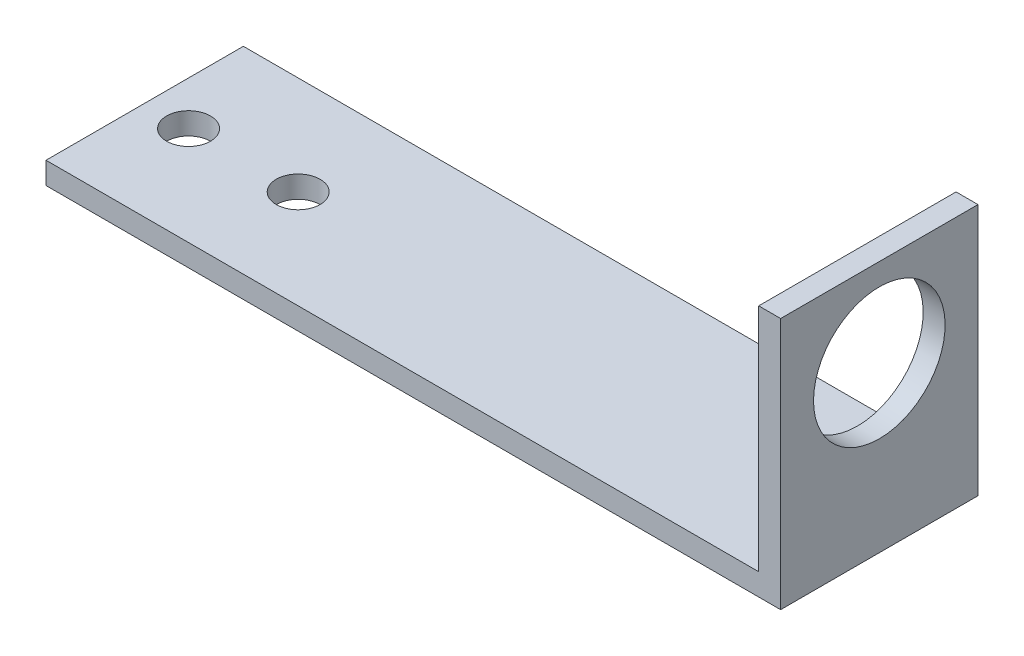
ISO-10303-21;
HEADER;
FILE_DESCRIPTION(('STEP AP214'),'2;1');
FILE_NAME('part.step','',(''),(''),'','','');
FILE_SCHEMA(('AUTOMOTIVE_DESIGN { 1 0 10303 214 1 1 1 1 }'));
ENDSEC;
DATA;
#1=APPLICATION_CONTEXT('core data for automotive mechanical design processes');
#2=APPLICATION_PROTOCOL_DEFINITION('international standard','automotive_design',2000,#1);
#3=PRODUCT_CONTEXT('',#1,'mechanical');
#4=PRODUCT('Part','Part','',(#3));
#5=PRODUCT_RELATED_PRODUCT_CATEGORY('part','',(#4));
#6=PRODUCT_DEFINITION_FORMATION('','',#4);
#7=PRODUCT_DEFINITION_CONTEXT('part definition',#1,'design');
#8=PRODUCT_DEFINITION('design','',#6,#7);
#9=PRODUCT_DEFINITION_SHAPE('','',#8);
#10=(LENGTH_UNIT() NAMED_UNIT(*) SI_UNIT(.MILLI.,.METRE.));
#11=(NAMED_UNIT(*) PLANE_ANGLE_UNIT() SI_UNIT($,.RADIAN.));
#12=(NAMED_UNIT(*) SI_UNIT($,.STERADIAN.) SOLID_ANGLE_UNIT());
#13=UNCERTAINTY_MEASURE_WITH_UNIT(LENGTH_MEASURE(1.E-05),#10,'distance_accuracy_value','');
#14=(GEOMETRIC_REPRESENTATION_CONTEXT(3) GLOBAL_UNCERTAINTY_ASSIGNED_CONTEXT((#13)) GLOBAL_UNIT_ASSIGNED_CONTEXT((#10,
#11,#12)) REPRESENTATION_CONTEXT('',''));
#15=CARTESIAN_POINT('',(0.,0.,0.));
#16=DIRECTION('',(0.,0.,1.));
#17=DIRECTION('',(1.,0.,0.));
#18=AXIS2_PLACEMENT_3D('',#15,#16,#17);
#19=CARTESIAN_POINT('',(-67.,0.,18.));
#20=DIRECTION('',(0.,1.,0.));
#21=DIRECTION('',(0.,0.,1.));
#22=AXIS2_PLACEMENT_3D('',#19,#20,#21);
#23=PLANE('',#22);
#24=CARTESIAN_POINT('',(-63.,0.,9.));
#25=DIRECTION('',(0.,1.,0.));
#26=DIRECTION('',(0.,0.,1.));
#27=AXIS2_PLACEMENT_3D('',#24,#25,#26);
#28=CIRCLE('',#27,2.);
#29=CARTESIAN_POINT('',(-63.,0.,11.));
#30=VERTEX_POINT('',#29);
#31=EDGE_CURVE('E162',#30,#30,#28,.F.);
#32=ORIENTED_EDGE('',*,*,#31,.F.);
#33=EDGE_LOOP('',(#32));
#34=FACE_BOUND('',#33,.T.);
#35=CARTESIAN_POINT('',(-53.,0.,9.));
#36=DIRECTION('',(0.,1.,0.));
#37=DIRECTION('',(0.,0.,1.));
#38=AXIS2_PLACEMENT_3D('',#35,#36,#37);
#39=CIRCLE('',#38,2.);
#40=CARTESIAN_POINT('',(-53.,0.,11.));
#41=VERTEX_POINT('',#40);
#42=EDGE_CURVE('E165',#41,#41,#39,.F.);
#43=ORIENTED_EDGE('',*,*,#42,.F.);
#44=EDGE_LOOP('',(#43));
#45=FACE_BOUND('',#44,.T.);
#46=DIRECTION('',(1.,0.,0.));
#47=VECTOR('',#46,1.);
#48=CARTESIAN_POINT('',(-67.,0.,0.));
#49=LINE('',#48,#47);
#50=CARTESIAN_POINT('',(-67.,0.,0.));
#51=VERTEX_POINT('',#50);
#52=CARTESIAN_POINT('',(0.,0.,0.));
#53=VERTEX_POINT('',#52);
#54=EDGE_CURVE('E117',#51,#53,#49,.T.);
#55=ORIENTED_EDGE('',*,*,#54,.T.);
#56=DIRECTION('',(0.,0.,-1.));
#57=VECTOR('',#56,1.);
#58=CARTESIAN_POINT('',(0.,0.,18.));
#59=LINE('',#58,#57);
#60=CARTESIAN_POINT('',(0.,0.,18.));
#61=VERTEX_POINT('',#60);
#62=EDGE_CURVE('E11',#61,#53,#59,.T.);
#63=ORIENTED_EDGE('',*,*,#62,.F.);
#64=DIRECTION('',(1.,0.,0.));
#65=VECTOR('',#64,1.);
#66=CARTESIAN_POINT('',(-67.,0.,18.));
#67=LINE('',#66,#65);
#68=CARTESIAN_POINT('',(-67.,0.,18.));
#69=VERTEX_POINT('',#68);
#70=EDGE_CURVE('E128',#69,#61,#67,.T.);
#71=ORIENTED_EDGE('',*,*,#70,.F.);
#72=DIRECTION('',(0.,0.,-1.));
#73=VECTOR('',#72,1.);
#74=CARTESIAN_POINT('',(-67.,0.,18.));
#75=LINE('',#74,#73);
#76=EDGE_CURVE('E113',#69,#51,#75,.T.);
#77=ORIENTED_EDGE('',*,*,#76,.T.);
#78=EDGE_LOOP('',(#55,#63,#71,#77));
#79=FACE_BOUND('',#78,.T.);
#80=ADVANCED_FACE('F33',(#34,#45,#79),#23,.F.);
#81=CARTESIAN_POINT('',(0.,0.,18.));
#82=DIRECTION('',(-1.,0.,0.));
#83=DIRECTION('',(0.,0.,1.));
#84=AXIS2_PLACEMENT_3D('',#81,#82,#83);
#85=PLANE('',#84);
#86=CARTESIAN_POINT('',(0.,15.,9.));
#87=DIRECTION('',(-1.,0.,0.));
#88=DIRECTION('',(0.,0.,1.));
#89=AXIS2_PLACEMENT_3D('',#86,#87,#88);
#90=CIRCLE('',#89,6.);
#91=CARTESIAN_POINT('',(0.,15.,15.));
#92=VERTEX_POINT('',#91);
#93=EDGE_CURVE('E121',#92,#92,#90,.F.);
#94=ORIENTED_EDGE('',*,*,#93,.F.);
#95=EDGE_LOOP('',(#94));
#96=FACE_BOUND('',#95,.T.);
#97=DIRECTION('',(0.,1.,0.));
#98=VECTOR('',#97,1.);
#99=CARTESIAN_POINT('',(0.,0.,0.));
#100=LINE('',#99,#98);
#101=CARTESIAN_POINT('',(0.,23.,0.));
#102=VERTEX_POINT('',#101);
#103=EDGE_CURVE('E120',#53,#102,#100,.T.);
#104=ORIENTED_EDGE('',*,*,#103,.T.);
#105=DIRECTION('',(0.,0.,-1.));
#106=VECTOR('',#105,1.);
#107=CARTESIAN_POINT('',(0.,23.,18.));
#108=LINE('',#107,#106);
#109=CARTESIAN_POINT('',(0.,23.,18.));
#110=VERTEX_POINT('',#109);
#111=EDGE_CURVE('E41',#110,#102,#108,.T.);
#112=ORIENTED_EDGE('',*,*,#111,.F.);
#113=DIRECTION('',(0.,1.,0.));
#114=VECTOR('',#113,1.);
#115=CARTESIAN_POINT('',(0.,0.,18.));
#116=LINE('',#115,#114);
#117=EDGE_CURVE('E86',#61,#110,#116,.T.);
#118=ORIENTED_EDGE('',*,*,#117,.F.);
#119=ORIENTED_EDGE('',*,*,#62,.T.);
#120=EDGE_LOOP('',(#104,#112,#118,#119));
#121=FACE_BOUND('',#120,.T.);
#122=ADVANCED_FACE('F153',(#96,#121),#85,.F.);
#123=CARTESIAN_POINT('',(0.,23.,18.));
#124=DIRECTION('',(0.,-1.,0.));
#125=DIRECTION('',(0.,0.,-1.));
#126=AXIS2_PLACEMENT_3D('',#123,#124,#125);
#127=PLANE('',#126);
#128=DIRECTION('',(-1.,0.,0.));
#129=VECTOR('',#128,1.);
#130=CARTESIAN_POINT('',(0.,23.,0.));
#131=LINE('',#130,#129);
#132=CARTESIAN_POINT('',(-2.,23.,0.));
#133=VERTEX_POINT('',#132);
#134=EDGE_CURVE('E123',#102,#133,#131,.T.);
#135=ORIENTED_EDGE('',*,*,#134,.T.);
#136=DIRECTION('',(0.,0.,-1.));
#137=VECTOR('',#136,1.);
#138=CARTESIAN_POINT('',(-2.,23.,18.));
#139=LINE('',#138,#137);
#140=CARTESIAN_POINT('',(-2.,23.,18.));
#141=VERTEX_POINT('',#140);
#142=EDGE_CURVE('E108',#141,#133,#139,.T.);
#143=ORIENTED_EDGE('',*,*,#142,.F.);
#144=DIRECTION('',(-1.,0.,0.));
#145=VECTOR('',#144,1.);
#146=CARTESIAN_POINT('',(0.,23.,18.));
#147=LINE('',#146,#145);
#148=EDGE_CURVE('E99',#110,#141,#147,.T.);
#149=ORIENTED_EDGE('',*,*,#148,.F.);
#150=ORIENTED_EDGE('',*,*,#111,.T.);
#151=EDGE_LOOP('',(#135,#143,#149,#150));
#152=FACE_BOUND('',#151,.T.);
#153=ADVANCED_FACE('F134',(#152),#127,.F.);
#154=CARTESIAN_POINT('',(-2.,23.,18.));
#155=DIRECTION('',(1.,0.,0.));
#156=DIRECTION('',(0.,1.,0.));
#157=AXIS2_PLACEMENT_3D('',#154,#155,#156);
#158=PLANE('',#157);
#159=CARTESIAN_POINT('',(-2.,15.,9.));
#160=DIRECTION('',(-1.,0.,0.));
#161=DIRECTION('',(0.,-1.,0.));
#162=AXIS2_PLACEMENT_3D('',#159,#160,#161);
#163=CIRCLE('',#162,6.);
#164=CARTESIAN_POINT('',(-2.,9.,9.));
#165=VERTEX_POINT('',#164);
#166=EDGE_CURVE('E176',#165,#165,#163,.T.);
#167=ORIENTED_EDGE('',*,*,#166,.F.);
#168=EDGE_LOOP('',(#167));
#169=FACE_BOUND('',#168,.T.);
#170=DIRECTION('',(0.,-1.,0.));
#171=VECTOR('',#170,1.);
#172=CARTESIAN_POINT('',(-2.,23.,0.));
#173=LINE('',#172,#171);
#174=CARTESIAN_POINT('',(-2.,2.00000000000001,0.));
#175=VERTEX_POINT('',#174);
#176=EDGE_CURVE('E107',#133,#175,#173,.T.);
#177=ORIENTED_EDGE('',*,*,#176,.T.);
#178=DIRECTION('',(0.,0.,-1.));
#179=VECTOR('',#178,1.);
#180=CARTESIAN_POINT('',(-2.,2.00000000000001,18.));
#181=LINE('',#180,#179);
#182=CARTESIAN_POINT('',(-2.,2.00000000000001,18.));
#183=VERTEX_POINT('',#182);
#184=EDGE_CURVE('E104',#183,#175,#181,.T.);
#185=ORIENTED_EDGE('',*,*,#184,.F.);
#186=DIRECTION('',(0.,-1.,0.));
#187=VECTOR('',#186,1.);
#188=CARTESIAN_POINT('',(-2.,23.,18.));
#189=LINE('',#188,#187);
#190=EDGE_CURVE('E93',#141,#183,#189,.T.);
#191=ORIENTED_EDGE('',*,*,#190,.F.);
#192=ORIENTED_EDGE('',*,*,#142,.T.);
#193=EDGE_LOOP('',(#177,#185,#191,#192));
#194=FACE_BOUND('',#193,.T.);
#195=ADVANCED_FACE('F105',(#169,#194),#158,.F.);
#196=CARTESIAN_POINT('',(-2.,2.00000000000001,18.));
#197=DIRECTION('',(0.,-1.,0.));
#198=DIRECTION('',(1.,0.,0.));
#199=AXIS2_PLACEMENT_3D('',#196,#197,#198);
#200=PLANE('',#199);
#201=CARTESIAN_POINT('',(-63.,2.,9.));
#202=DIRECTION('',(0.,1.,0.));
#203=DIRECTION('',(-1.,0.,0.));
#204=AXIS2_PLACEMENT_3D('',#201,#202,#203);
#205=CIRCLE('',#204,2.);
#206=CARTESIAN_POINT('',(-65.,2.,9.));
#207=VERTEX_POINT('',#206);
#208=EDGE_CURVE('E167',#207,#207,#205,.T.);
#209=ORIENTED_EDGE('',*,*,#208,.F.);
#210=EDGE_LOOP('',(#209));
#211=FACE_BOUND('',#210,.T.);
#212=CARTESIAN_POINT('',(-53.,2.,9.));
#213=DIRECTION('',(0.,1.,0.));
#214=DIRECTION('',(-1.,0.,0.));
#215=AXIS2_PLACEMENT_3D('',#212,#213,#214);
#216=CIRCLE('',#215,2.);
#217=CARTESIAN_POINT('',(-55.,2.,9.));
#218=VERTEX_POINT('',#217);
#219=EDGE_CURVE('E168',#218,#218,#216,.T.);
#220=ORIENTED_EDGE('',*,*,#219,.F.);
#221=EDGE_LOOP('',(#220));
#222=FACE_BOUND('',#221,.T.);
#223=DIRECTION('',(-1.,0.,0.));
#224=VECTOR('',#223,1.);
#225=CARTESIAN_POINT('',(-2.,2.00000000000001,0.));
#226=LINE('',#225,#224);
#227=CARTESIAN_POINT('',(-67.,2.,0.));
#228=VERTEX_POINT('',#227);
#229=EDGE_CURVE('E72',#175,#228,#226,.T.);
#230=ORIENTED_EDGE('',*,*,#229,.T.);
#231=DIRECTION('',(0.,0.,-1.));
#232=VECTOR('',#231,1.);
#233=CARTESIAN_POINT('',(-67.,2.,18.));
#234=LINE('',#233,#232);
#235=CARTESIAN_POINT('',(-67.,2.,18.));
#236=VERTEX_POINT('',#235);
#237=EDGE_CURVE('E109',#236,#228,#234,.T.);
#238=ORIENTED_EDGE('',*,*,#237,.F.);
#239=DIRECTION('',(-1.,0.,0.));
#240=VECTOR('',#239,1.);
#241=CARTESIAN_POINT('',(-2.,2.00000000000001,18.));
#242=LINE('',#241,#240);
#243=EDGE_CURVE('E97',#183,#236,#242,.T.);
#244=ORIENTED_EDGE('',*,*,#243,.F.);
#245=ORIENTED_EDGE('',*,*,#184,.T.);
#246=EDGE_LOOP('',(#230,#238,#244,#245));
#247=FACE_BOUND('',#246,.T.);
#248=ADVANCED_FACE('F111',(#211,#222,#247),#200,.F.);
#249=CARTESIAN_POINT('',(-67.,2.,18.));
#250=DIRECTION('',(1.,0.,0.));
#251=DIRECTION('',(0.,0.,-1.));
#252=AXIS2_PLACEMENT_3D('',#249,#250,#251);
#253=PLANE('',#252);
#254=DIRECTION('',(0.,-1.,0.));
#255=VECTOR('',#254,1.);
#256=CARTESIAN_POINT('',(-67.,2.,0.));
#257=LINE('',#256,#255);
#258=EDGE_CURVE('E78',#228,#51,#257,.T.);
#259=ORIENTED_EDGE('',*,*,#258,.T.);
#260=ORIENTED_EDGE('',*,*,#76,.F.);
#261=DIRECTION('',(0.,-1.,0.));
#262=VECTOR('',#261,1.);
#263=CARTESIAN_POINT('',(-67.,2.,18.));
#264=LINE('',#263,#262);
#265=EDGE_CURVE('E49',#236,#69,#264,.T.);
#266=ORIENTED_EDGE('',*,*,#265,.F.);
#267=ORIENTED_EDGE('',*,*,#237,.T.);
#268=EDGE_LOOP('',(#259,#260,#266,#267));
#269=FACE_BOUND('',#268,.T.);
#270=ADVANCED_FACE('F141',(#269),#253,.F.);
#271=CARTESIAN_POINT('',(0.,0.,18.));
#272=DIRECTION('',(0.,0.,1.));
#273=DIRECTION('',(1.,0.,0.));
#274=AXIS2_PLACEMENT_3D('',#271,#272,#273);
#275=PLANE('',#274);
#276=ORIENTED_EDGE('',*,*,#70,.T.);
#277=ORIENTED_EDGE('',*,*,#117,.T.);
#278=ORIENTED_EDGE('',*,*,#148,.T.);
#279=ORIENTED_EDGE('',*,*,#190,.T.);
#280=ORIENTED_EDGE('',*,*,#243,.T.);
#281=ORIENTED_EDGE('',*,*,#265,.T.);
#282=EDGE_LOOP('',(#276,#277,#278,#279,#280,#281));
#283=FACE_BOUND('',#282,.T.);
#284=ADVANCED_FACE('F95',(#283),#275,.T.);
#285=CARTESIAN_POINT('',(0.,0.,0.));
#286=DIRECTION('',(0.,0.,1.));
#287=DIRECTION('',(1.,0.,0.));
#288=AXIS2_PLACEMENT_3D('',#285,#286,#287);
#289=PLANE('',#288);
#290=ORIENTED_EDGE('',*,*,#54,.F.);
#291=ORIENTED_EDGE('',*,*,#258,.F.);
#292=ORIENTED_EDGE('',*,*,#229,.F.);
#293=ORIENTED_EDGE('',*,*,#176,.F.);
#294=ORIENTED_EDGE('',*,*,#134,.F.);
#295=ORIENTED_EDGE('',*,*,#103,.F.);
#296=EDGE_LOOP('',(#290,#291,#292,#293,#294,#295));
#297=FACE_BOUND('',#296,.T.);
#298=ADVANCED_FACE('F137',(#297),#289,.F.);
#299=CARTESIAN_POINT('',(0.001000000000001,15.,9.));
#300=DIRECTION('',(-1.,0.,0.));
#301=DIRECTION('',(0.,-1.,0.));
#302=AXIS2_PLACEMENT_3D('',#299,#300,#301);
#303=CYLINDRICAL_SURFACE('',#302,6.);
#304=ORIENTED_EDGE('',*,*,#166,.T.);
#305=EDGE_LOOP('',(#304));
#306=FACE_BOUND('',#305,.T.);
#307=ORIENTED_EDGE('',*,*,#93,.T.);
#308=EDGE_LOOP('',(#307));
#309=FACE_BOUND('',#308,.T.);
#310=ADVANCED_FACE('F184',(#306,#309),#303,.F.);
#311=CARTESIAN_POINT('',(-53.,-0.00100000000000707,9.));
#312=DIRECTION('',(0.,1.,0.));
#313=DIRECTION('',(-1.,0.,0.));
#314=AXIS2_PLACEMENT_3D('',#311,#312,#313);
#315=CYLINDRICAL_SURFACE('',#314,2.);
#316=ORIENTED_EDGE('',*,*,#219,.T.);
#317=EDGE_LOOP('',(#316));
#318=FACE_BOUND('',#317,.T.);
#319=ORIENTED_EDGE('',*,*,#42,.T.);
#320=EDGE_LOOP('',(#319));
#321=FACE_BOUND('',#320,.T.);
#322=ADVANCED_FACE('F186',(#318,#321),#315,.F.);
#323=CARTESIAN_POINT('',(-63.,-0.00100000000000837,9.));
#324=DIRECTION('',(0.,1.,0.));
#325=DIRECTION('',(-1.,0.,0.));
#326=AXIS2_PLACEMENT_3D('',#323,#324,#325);
#327=CYLINDRICAL_SURFACE('',#326,2.);
#328=ORIENTED_EDGE('',*,*,#208,.T.);
#329=EDGE_LOOP('',(#328));
#330=FACE_BOUND('',#329,.T.);
#331=ORIENTED_EDGE('',*,*,#31,.T.);
#332=EDGE_LOOP('',(#331));
#333=FACE_BOUND('',#332,.T.);
#334=ADVANCED_FACE('F193',(#330,#333),#327,.F.);
#335=CLOSED_SHELL('',(#80,#122,#153,#195,#248,#270,#284,#298,#310,#322,#334));
#336=MANIFOLD_SOLID_BREP('B2',#335);
#337=ADVANCED_BREP_SHAPE_REPRESENTATION('',(#18,#336),#14);
#338=SHAPE_DEFINITION_REPRESENTATION(#9,#337);
ENDSEC;
END-ISO-10303-21;
